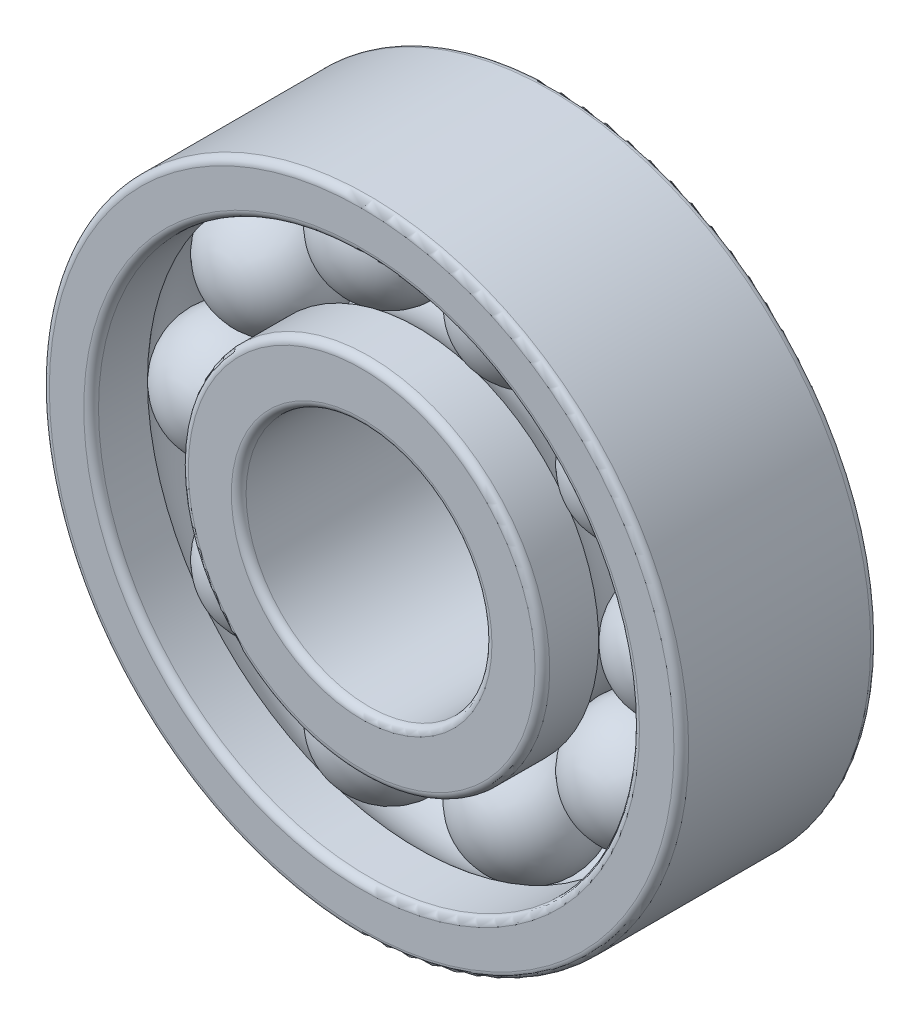
ISO-10303-21;
HEADER;
FILE_DESCRIPTION(('STEP AP214'),'2;1');
FILE_NAME('part.step','',(''),(''),'','','');
FILE_SCHEMA(('AUTOMOTIVE_DESIGN { 1 0 10303 214 1 1 1 1 }'));
ENDSEC;
DATA;
#1=APPLICATION_CONTEXT('core data for automotive mechanical design processes');
#2=APPLICATION_PROTOCOL_DEFINITION('international standard','automotive_design',2000,#1);
#3=PRODUCT_CONTEXT('',#1,'mechanical');
#4=PRODUCT('Part','Part','',(#3));
#5=PRODUCT_RELATED_PRODUCT_CATEGORY('part','',(#4));
#6=PRODUCT_DEFINITION_FORMATION('','',#4);
#7=PRODUCT_DEFINITION_CONTEXT('part definition',#1,'design');
#8=PRODUCT_DEFINITION('design','',#6,#7);
#9=PRODUCT_DEFINITION_SHAPE('','',#8);
#10=(LENGTH_UNIT() NAMED_UNIT(*) SI_UNIT(.MILLI.,.METRE.));
#11=(NAMED_UNIT(*) PLANE_ANGLE_UNIT() SI_UNIT($,.RADIAN.));
#12=(NAMED_UNIT(*) SI_UNIT($,.STERADIAN.) SOLID_ANGLE_UNIT());
#13=UNCERTAINTY_MEASURE_WITH_UNIT(LENGTH_MEASURE(1.E-05),#10,'distance_accuracy_value','');
#14=(GEOMETRIC_REPRESENTATION_CONTEXT(3) GLOBAL_UNCERTAINTY_ASSIGNED_CONTEXT((#13)) GLOBAL_UNIT_ASSIGNED_CONTEXT((#10,
#11,#12)) REPRESENTATION_CONTEXT('',''));
#15=CARTESIAN_POINT('',(0.,0.,0.));
#16=DIRECTION('',(0.,0.,1.));
#17=DIRECTION('',(1.,0.,0.));
#18=AXIS2_PLACEMENT_3D('',#15,#16,#17);
#19=CARTESIAN_POINT('',(-7.42273092339021,5.39292968978334,4.));
#20=DIRECTION('',(0.,0.,-1.));
#21=DIRECTION('',(0.809016994374955,-0.587785252292462,0.));
#22=AXIS2_PLACEMENT_3D('',#19,#20,#21);
#23=SPHERICAL_SURFACE('',#22,2.5);
#24=CARTESIAN_POINT('',(-7.42273092339021,5.39292968978334,1.5));
#25=VERTEX_POINT('',#24);
#26=VERTEX_LOOP('',#25);
#27=FACE_BOUND('',#26,.T.);
#28=ADVANCED_FACE('F74',(#27),#23,.T.);
#29=CLOSED_SHELL('',(#28));
#30=MANIFOLD_SOLID_BREP('B2',#29);
#31=CARTESIAN_POINT('',(-2.83523092339024,8.725943537008,4.));
#32=DIRECTION('',(0.,0.,-1.));
#33=DIRECTION('',(0.309016994374958,-0.95105651629515,0.));
#34=AXIS2_PLACEMENT_3D('',#31,#32,#33);
#35=SPHERICAL_SURFACE('',#34,2.5);
#36=CARTESIAN_POINT('',(-2.83523092339024,8.725943537008,1.5));
#37=VERTEX_POINT('',#36);
#38=VERTEX_LOOP('',#37);
#39=FACE_BOUND('',#38,.T.);
#40=ADVANCED_FACE('F93',(#39),#35,.T.);
#41=CLOSED_SHELL('',(#40));
#42=MANIFOLD_SOLID_BREP('B7',#41);
#43=CARTESIAN_POINT('',(2.83523092339006,8.72594353700806,4.));
#44=DIRECTION('',(0.,0.,-1.));
#45=DIRECTION('',(-0.309016994374938,-0.951056516295157,0.));
#46=AXIS2_PLACEMENT_3D('',#43,#44,#45);
#47=SPHERICAL_SURFACE('',#46,2.5);
#48=CARTESIAN_POINT('',(2.83523092339006,8.72594353700806,1.5));
#49=VERTEX_POINT('',#48);
#50=VERTEX_LOOP('',#49);
#51=FACE_BOUND('',#50,.T.);
#52=ADVANCED_FACE('F112',(#51),#47,.T.);
#53=CLOSED_SHELL('',(#52));
#54=MANIFOLD_SOLID_BREP('B70',#53);
#55=CARTESIAN_POINT('',(7.4227309233901,5.39292968978351,4.));
#56=DIRECTION('',(0.,0.,-1.));
#57=DIRECTION('',(-0.809016994374942,-0.58778525229248,0.));
#58=AXIS2_PLACEMENT_3D('',#55,#56,#57);
#59=SPHERICAL_SURFACE('',#58,2.5);
#60=CARTESIAN_POINT('',(7.4227309233901,5.39292968978351,1.5));
#61=VERTEX_POINT('',#60);
#62=VERTEX_LOOP('',#61);
#63=FACE_BOUND('',#62,.T.);
#64=ADVANCED_FACE('F131',(#63),#59,.T.);
#65=CLOSED_SHELL('',(#64));
#66=MANIFOLD_SOLID_BREP('B89',#65);
#67=CARTESIAN_POINT('',(9.175,0.,4.));
#68=DIRECTION('',(0.,0.,-1.));
#69=DIRECTION('',(-1.,0.,0.));
#70=AXIS2_PLACEMENT_3D('',#67,#68,#69);
#71=SPHERICAL_SURFACE('',#70,2.5);
#72=CARTESIAN_POINT('',(9.175,0.,1.5));
#73=VERTEX_POINT('',#72);
#74=VERTEX_LOOP('',#73);
#75=FACE_BOUND('',#74,.T.);
#76=ADVANCED_FACE('F150',(#75),#71,.T.);
#77=CLOSED_SHELL('',(#76));
#78=MANIFOLD_SOLID_BREP('B108',#77);
#79=CARTESIAN_POINT('',(7.42273092339017,-5.3929296897834,4.));
#80=DIRECTION('',(0.,0.,-1.));
#81=DIRECTION('',(-0.809016994374951,0.587785252292469,0.));
#82=AXIS2_PLACEMENT_3D('',#79,#80,#81);
#83=SPHERICAL_SURFACE('',#82,2.5);
#84=CARTESIAN_POINT('',(7.42273092339017,-5.3929296897834,1.5));
#85=VERTEX_POINT('',#84);
#86=VERTEX_LOOP('',#85);
#87=FACE_BOUND('',#86,.T.);
#88=ADVANCED_FACE('F169',(#87),#83,.T.);
#89=CLOSED_SHELL('',(#88));
#90=MANIFOLD_SOLID_BREP('B127',#89);
#91=CARTESIAN_POINT('',(2.83523092339018,-8.72594353700802,4.));
#92=DIRECTION('',(0.,0.,-1.));
#93=DIRECTION('',(-0.309016994374952,0.951056516295152,0.));
#94=AXIS2_PLACEMENT_3D('',#91,#92,#93);
#95=SPHERICAL_SURFACE('',#94,2.5);
#96=CARTESIAN_POINT('',(2.83523092339018,-8.72594353700802,1.5));
#97=VERTEX_POINT('',#96);
#98=VERTEX_LOOP('',#97);
#99=FACE_BOUND('',#98,.T.);
#100=ADVANCED_FACE('F188',(#99),#95,.T.);
#101=CLOSED_SHELL('',(#100));
#102=MANIFOLD_SOLID_BREP('B146',#101);
#103=CARTESIAN_POINT('',(-2.83523092339012,-8.72594353700804,4.));
#104=DIRECTION('',(0.,0.,-1.));
#105=DIRECTION('',(0.309016994374945,0.951056516295155,0.));
#106=AXIS2_PLACEMENT_3D('',#103,#104,#105);
#107=SPHERICAL_SURFACE('',#106,2.5);
#108=CARTESIAN_POINT('',(-2.83523092339012,-8.72594353700804,1.5));
#109=VERTEX_POINT('',#108);
#110=VERTEX_LOOP('',#109);
#111=FACE_BOUND('',#110,.T.);
#112=ADVANCED_FACE('F207',(#111),#107,.T.);
#113=CLOSED_SHELL('',(#112));
#114=MANIFOLD_SOLID_BREP('B165',#113);
#115=CARTESIAN_POINT('',(-7.42273092339014,-5.39292968978345,4.));
#116=DIRECTION('',(0.,0.,-1.));
#117=DIRECTION('',(0.809016994374947,0.587785252292474,0.));
#118=AXIS2_PLACEMENT_3D('',#115,#116,#117);
#119=SPHERICAL_SURFACE('',#118,2.5);
#120=CARTESIAN_POINT('',(-7.42273092339014,-5.39292968978345,1.5));
#121=VERTEX_POINT('',#120);
#122=VERTEX_LOOP('',#121);
#123=FACE_BOUND('',#122,.T.);
#124=ADVANCED_FACE('F226',(#123),#119,.T.);
#125=CLOSED_SHELL('',(#124));
#126=MANIFOLD_SOLID_BREP('B184',#125);
#127=CARTESIAN_POINT('',(-9.175,0.,4.));
#128=DIRECTION('',(0.,0.,-1.));
#129=DIRECTION('',(1.,0.,0.));
#130=AXIS2_PLACEMENT_3D('',#127,#128,#129);
#131=SPHERICAL_SURFACE('',#130,2.5);
#132=CARTESIAN_POINT('',(-9.175,0.,1.5));
#133=VERTEX_POINT('',#132);
#134=VERTEX_LOOP('',#133);
#135=FACE_BOUND('',#134,.T.);
#136=ADVANCED_FACE('F247',(#135),#131,.T.);
#137=CLOSED_SHELL('',(#136));
#138=MANIFOLD_SOLID_BREP('B203',#137);
#139=CARTESIAN_POINT('',(0.,0.,8.));
#140=DIRECTION('',(0.,0.,-1.));
#141=DIRECTION('',(-1.,0.,0.));
#142=AXIS2_PLACEMENT_3D('',#139,#140,#141);
#143=CYLINDRICAL_SURFACE('',#142,7.35);
#144=CARTESIAN_POINT('',(0.,0.,0.3));
#145=DIRECTION('',(0.,0.,1.));
#146=DIRECTION('',(1.,0.,0.));
#147=AXIS2_PLACEMENT_3D('',#144,#145,#146);
#148=CIRCLE('',#147,7.35);
#149=CARTESIAN_POINT('',(7.35,0.,0.3));
#150=VERTEX_POINT('',#149);
#151=EDGE_CURVE('E246',#150,#150,#148,.T.);
#152=ORIENTED_EDGE('',*,*,#151,.T.);
#153=EDGE_LOOP('',(#152));
#154=FACE_BOUND('',#153,.T.);
#155=CARTESIAN_POINT('',(0.,0.,2.29138213751582));
#156=DIRECTION('',(0.,0.,1.));
#157=DIRECTION('',(1.,0.,0.));
#158=AXIS2_PLACEMENT_3D('',#155,#156,#157);
#159=CIRCLE('',#158,7.35);
#160=CARTESIAN_POINT('',(7.35,0.,2.29138213751582));
#161=VERTEX_POINT('',#160);
#162=EDGE_CURVE('E299',#161,#161,#159,.F.);
#163=ORIENTED_EDGE('',*,*,#162,.T.);
#164=EDGE_LOOP('',(#163));
#165=FACE_BOUND('',#164,.T.);
#166=ADVANCED_FACE('F267',(#154,#165),#143,.T.);
#167=CARTESIAN_POINT('',(0.,0.,8.));
#168=DIRECTION('',(0.,0.,1.));
#169=DIRECTION('',(1.,0.,0.));
#170=AXIS2_PLACEMENT_3D('',#167,#168,#169);
#171=PLANE('',#170);
#172=CARTESIAN_POINT('',(0.,0.,8.));
#173=DIRECTION('',(0.,0.,1.));
#174=DIRECTION('',(1.,0.,0.));
#175=AXIS2_PLACEMENT_3D('',#172,#173,#174);
#176=CIRCLE('',#175,5.3);
#177=CARTESIAN_POINT('',(5.3,0.,8.));
#178=VERTEX_POINT('',#177);
#179=EDGE_CURVE('E287',#178,#178,#176,.F.);
#180=ORIENTED_EDGE('',*,*,#179,.T.);
#181=EDGE_LOOP('',(#180));
#182=FACE_BOUND('',#181,.T.);
#183=CARTESIAN_POINT('',(0.,0.,8.));
#184=DIRECTION('',(0.,0.,1.));
#185=DIRECTION('',(1.,0.,0.));
#186=AXIS2_PLACEMENT_3D('',#183,#184,#185);
#187=CIRCLE('',#186,7.05);
#188=CARTESIAN_POINT('',(7.05,0.,8.));
#189=VERTEX_POINT('',#188);
#190=EDGE_CURVE('E290',#189,#189,#187,.T.);
#191=ORIENTED_EDGE('',*,*,#190,.T.);
#192=EDGE_LOOP('',(#191));
#193=FACE_BOUND('',#192,.T.);
#194=ADVANCED_FACE('F317',(#182,#193),#171,.T.);
#195=CARTESIAN_POINT('',(0.,0.,0.));
#196=DIRECTION('',(0.,0.,1.));
#197=DIRECTION('',(1.,0.,0.));
#198=AXIS2_PLACEMENT_3D('',#195,#196,#197);
#199=PLANE('',#198);
#200=CARTESIAN_POINT('',(0.,0.,0.));
#201=DIRECTION('',(0.,0.,1.));
#202=DIRECTION('',(1.,0.,0.));
#203=AXIS2_PLACEMENT_3D('',#200,#201,#202);
#204=CIRCLE('',#203,5.3);
#205=CARTESIAN_POINT('',(5.3,0.,0.));
#206=VERTEX_POINT('',#205);
#207=EDGE_CURVE('E274',#206,#206,#204,.T.);
#208=ORIENTED_EDGE('',*,*,#207,.T.);
#209=EDGE_LOOP('',(#208));
#210=FACE_BOUND('',#209,.T.);
#211=CARTESIAN_POINT('',(0.,0.,0.));
#212=DIRECTION('',(0.,0.,1.));
#213=DIRECTION('',(1.,0.,0.));
#214=AXIS2_PLACEMENT_3D('',#211,#212,#213);
#215=CIRCLE('',#214,7.05);
#216=CARTESIAN_POINT('',(7.05,0.,0.));
#217=VERTEX_POINT('',#216);
#218=EDGE_CURVE('E278',#217,#217,#215,.F.);
#219=ORIENTED_EDGE('',*,*,#218,.T.);
#220=EDGE_LOOP('',(#219));
#221=FACE_BOUND('',#220,.T.);
#222=ADVANCED_FACE('F322',(#210,#221),#199,.F.);
#223=CARTESIAN_POINT('',(0.,0.,7.7));
#224=DIRECTION('',(0.,0.,1.));
#225=DIRECTION('',(1.,0.,0.));
#226=AXIS2_PLACEMENT_3D('',#223,#224,#225);
#227=CIRCLE('',#226,7.35);
#228=CARTESIAN_POINT('',(7.35,0.,7.7));
#229=VERTEX_POINT('',#228);
#230=EDGE_CURVE('E282',#229,#229,#227,.F.);
#231=ORIENTED_EDGE('',*,*,#230,.T.);
#232=EDGE_LOOP('',(#231));
#233=FACE_BOUND('',#232,.T.);
#234=CARTESIAN_POINT('',(0.,0.,5.70861786248418));
#235=DIRECTION('',(0.,0.,-1.));
#236=DIRECTION('',(-1.,0.,0.));
#237=AXIS2_PLACEMENT_3D('',#234,#235,#236);
#238=CIRCLE('',#237,7.35);
#239=CARTESIAN_POINT('',(-7.35,0.,5.70861786248418));
#240=VERTEX_POINT('',#239);
#241=EDGE_CURVE('E302',#240,#240,#238,.F.);
#242=ORIENTED_EDGE('',*,*,#241,.T.);
#243=EDGE_LOOP('',(#242));
#244=FACE_BOUND('',#243,.T.);
#245=ADVANCED_FACE('F306',(#233,#244),#143,.T.);
#246=CARTESIAN_POINT('',(0.,0.,8.));
#247=DIRECTION('',(0.,0.,-1.));
#248=DIRECTION('',(-1.,0.,0.));
#249=AXIS2_PLACEMENT_3D('',#246,#247,#248);
#250=CYLINDRICAL_SURFACE('',#249,5.);
#251=CARTESIAN_POINT('',(0.,0.,7.7));
#252=DIRECTION('',(0.,0.,1.));
#253=DIRECTION('',(1.,0.,0.));
#254=AXIS2_PLACEMENT_3D('',#251,#252,#253);
#255=CIRCLE('',#254,5.);
#256=CARTESIAN_POINT('',(5.,0.,7.7));
#257=VERTEX_POINT('',#256);
#258=EDGE_CURVE('E293',#257,#257,#255,.T.);
#259=ORIENTED_EDGE('',*,*,#258,.T.);
#260=EDGE_LOOP('',(#259));
#261=FACE_BOUND('',#260,.T.);
#262=CARTESIAN_POINT('',(0.,0.,0.3));
#263=DIRECTION('',(0.,0.,1.));
#264=DIRECTION('',(1.,0.,0.));
#265=AXIS2_PLACEMENT_3D('',#262,#263,#264);
#266=CIRCLE('',#265,5.);
#267=CARTESIAN_POINT('',(5.,0.,0.3));
#268=VERTEX_POINT('',#267);
#269=EDGE_CURVE('E296',#268,#268,#266,.F.);
#270=ORIENTED_EDGE('',*,*,#269,.T.);
#271=EDGE_LOOP('',(#270));
#272=FACE_BOUND('',#271,.T.);
#273=ADVANCED_FACE('F312',(#261,#272),#250,.F.);
#274=CARTESIAN_POINT('',(0.,0.,4.));
#275=DIRECTION('',(0.,0.,-1.));
#276=DIRECTION('',(-1.,0.,0.));
#277=AXIS2_PLACEMENT_3D('',#274,#275,#276);
#278=TOROIDAL_SURFACE('',#277,9.175,2.5);
#279=ORIENTED_EDGE('',*,*,#241,.F.);
#280=EDGE_LOOP('',(#279));
#281=FACE_BOUND('',#280,.T.);
#282=ORIENTED_EDGE('',*,*,#162,.F.);
#283=EDGE_LOOP('',(#282));
#284=FACE_BOUND('',#283,.T.);
#285=ADVANCED_FACE('F308',(#281,#284),#278,.F.);
#286=CARTESIAN_POINT('',(0.,0.,7.7));
#287=DIRECTION('',(0.,0.,1.));
#288=DIRECTION('',(1.,0.,0.));
#289=AXIS2_PLACEMENT_3D('',#286,#287,#288);
#290=TOROIDAL_SURFACE('',#289,5.3,0.3);
#291=ORIENTED_EDGE('',*,*,#179,.F.);
#292=EDGE_LOOP('',(#291));
#293=FACE_BOUND('',#292,.T.);
#294=ORIENTED_EDGE('',*,*,#258,.F.);
#295=EDGE_LOOP('',(#294));
#296=FACE_BOUND('',#295,.T.);
#297=ADVANCED_FACE('F311',(#293,#296),#290,.T.);
#298=CARTESIAN_POINT('',(0.,0.,7.7));
#299=DIRECTION('',(0.,0.,1.));
#300=DIRECTION('',(1.,0.,0.));
#301=AXIS2_PLACEMENT_3D('',#298,#299,#300);
#302=TOROIDAL_SURFACE('',#301,7.05,0.3);
#303=ORIENTED_EDGE('',*,*,#230,.F.);
#304=EDGE_LOOP('',(#303));
#305=FACE_BOUND('',#304,.T.);
#306=ORIENTED_EDGE('',*,*,#190,.F.);
#307=EDGE_LOOP('',(#306));
#308=FACE_BOUND('',#307,.T.);
#309=ADVANCED_FACE('F336',(#305,#308),#302,.T.);
#310=CARTESIAN_POINT('',(0.,0.,0.3));
#311=DIRECTION('',(0.,0.,1.));
#312=DIRECTION('',(1.,0.,0.));
#313=AXIS2_PLACEMENT_3D('',#310,#311,#312);
#314=TOROIDAL_SURFACE('',#313,5.3,0.3);
#315=ORIENTED_EDGE('',*,*,#269,.F.);
#316=EDGE_LOOP('',(#315));
#317=FACE_BOUND('',#316,.T.);
#318=ORIENTED_EDGE('',*,*,#207,.F.);
#319=EDGE_LOOP('',(#318));
#320=FACE_BOUND('',#319,.T.);
#321=ADVANCED_FACE('F339',(#317,#320),#314,.T.);
#322=CARTESIAN_POINT('',(0.,0.,0.3));
#323=DIRECTION('',(0.,0.,1.));
#324=DIRECTION('',(1.,0.,0.));
#325=AXIS2_PLACEMENT_3D('',#322,#323,#324);
#326=TOROIDAL_SURFACE('',#325,7.05,0.3);
#327=ORIENTED_EDGE('',*,*,#218,.F.);
#328=EDGE_LOOP('',(#327));
#329=FACE_BOUND('',#328,.T.);
#330=ORIENTED_EDGE('',*,*,#151,.F.);
#331=EDGE_LOOP('',(#330));
#332=FACE_BOUND('',#331,.T.);
#333=ADVANCED_FACE('F269',(#329,#332),#326,.T.);
#334=CLOSED_SHELL('',(#166,#194,#222,#245,#273,#285,#297,#309,#321,#333));
#335=MANIFOLD_SOLID_BREP('B222',#334);
#336=CARTESIAN_POINT('',(0.,0.,8.));
#337=DIRECTION('',(0.,0.,-1.));
#338=DIRECTION('',(-1.,0.,0.));
#339=AXIS2_PLACEMENT_3D('',#336,#337,#338);
#340=CYLINDRICAL_SURFACE('',#339,11.);
#341=CARTESIAN_POINT('',(0.,0.,0.3));
#342=DIRECTION('',(0.,0.,1.));
#343=DIRECTION('',(1.,0.,0.));
#344=AXIS2_PLACEMENT_3D('',#341,#342,#343);
#345=CIRCLE('',#344,11.);
#346=CARTESIAN_POINT('',(11.,0.,0.3));
#347=VERTEX_POINT('',#346);
#348=EDGE_CURVE('E441',#347,#347,#345,.F.);
#349=ORIENTED_EDGE('',*,*,#348,.T.);
#350=EDGE_LOOP('',(#349));
#351=FACE_BOUND('',#350,.T.);
#352=CARTESIAN_POINT('',(0.,0.,2.29138213751582));
#353=DIRECTION('',(0.,0.,1.));
#354=DIRECTION('',(1.,0.,0.));
#355=AXIS2_PLACEMENT_3D('',#352,#353,#354);
#356=CIRCLE('',#355,11.);
#357=CARTESIAN_POINT('',(11.,0.,2.29138213751582));
#358=VERTEX_POINT('',#357);
#359=EDGE_CURVE('E450',#358,#358,#356,.F.);
#360=ORIENTED_EDGE('',*,*,#359,.F.);
#361=EDGE_LOOP('',(#360));
#362=FACE_BOUND('',#361,.T.);
#363=ADVANCED_FACE('F418',(#351,#362),#340,.F.);
#364=CARTESIAN_POINT('',(0.,0.,8.));
#365=DIRECTION('',(0.,0.,1.));
#366=DIRECTION('',(1.,0.,0.));
#367=AXIS2_PLACEMENT_3D('',#364,#365,#366);
#368=PLANE('',#367);
#369=CARTESIAN_POINT('',(0.,0.,8.));
#370=DIRECTION('',(0.,0.,1.));
#371=DIRECTION('',(1.,0.,0.));
#372=AXIS2_PLACEMENT_3D('',#369,#370,#371);
#373=CIRCLE('',#372,11.3);
#374=CARTESIAN_POINT('',(11.3,0.,8.));
#375=VERTEX_POINT('',#374);
#376=EDGE_CURVE('E266',#375,#375,#373,.F.);
#377=ORIENTED_EDGE('',*,*,#376,.T.);
#378=EDGE_LOOP('',(#377));
#379=FACE_BOUND('',#378,.T.);
#380=CARTESIAN_POINT('',(0.,0.,8.));
#381=DIRECTION('',(0.,0.,1.));
#382=DIRECTION('',(1.,0.,0.));
#383=AXIS2_PLACEMENT_3D('',#380,#381,#382);
#384=CIRCLE('',#383,12.7);
#385=CARTESIAN_POINT('',(12.7,0.,8.));
#386=VERTEX_POINT('',#385);
#387=EDGE_CURVE('E425',#386,#386,#384,.T.);
#388=ORIENTED_EDGE('',*,*,#387,.T.);
#389=EDGE_LOOP('',(#388));
#390=FACE_BOUND('',#389,.T.);
#391=ADVANCED_FACE('F476',(#379,#390),#368,.T.);
#392=CARTESIAN_POINT('',(0.,0.,0.));
#393=DIRECTION('',(0.,0.,1.));
#394=DIRECTION('',(1.,0.,0.));
#395=AXIS2_PLACEMENT_3D('',#392,#393,#394);
#396=PLANE('',#395);
#397=CARTESIAN_POINT('',(0.,0.,0.));
#398=DIRECTION('',(0.,0.,1.));
#399=DIRECTION('',(1.,0.,0.));
#400=AXIS2_PLACEMENT_3D('',#397,#398,#399);
#401=CIRCLE('',#400,11.3);
#402=CARTESIAN_POINT('',(11.3,0.,0.));
#403=VERTEX_POINT('',#402);
#404=EDGE_CURVE('E444',#403,#403,#401,.T.);
#405=ORIENTED_EDGE('',*,*,#404,.T.);
#406=EDGE_LOOP('',(#405));
#407=FACE_BOUND('',#406,.T.);
#408=CARTESIAN_POINT('',(0.,0.,0.));
#409=DIRECTION('',(0.,0.,1.));
#410=DIRECTION('',(1.,0.,0.));
#411=AXIS2_PLACEMENT_3D('',#408,#409,#410);
#412=CIRCLE('',#411,12.7);
#413=CARTESIAN_POINT('',(12.7,0.,0.));
#414=VERTEX_POINT('',#413);
#415=EDGE_CURVE('E447',#414,#414,#412,.F.);
#416=ORIENTED_EDGE('',*,*,#415,.T.);
#417=EDGE_LOOP('',(#416));
#418=FACE_BOUND('',#417,.T.);
#419=ADVANCED_FACE('F471',(#407,#418),#396,.F.);
#420=CARTESIAN_POINT('',(0.,0.,8.));
#421=DIRECTION('',(0.,0.,-1.));
#422=DIRECTION('',(-1.,0.,0.));
#423=AXIS2_PLACEMENT_3D('',#420,#421,#422);
#424=CYLINDRICAL_SURFACE('',#423,13.);
#425=CARTESIAN_POINT('',(0.,0.,0.3));
#426=DIRECTION('',(0.,0.,1.));
#427=DIRECTION('',(1.,0.,0.));
#428=AXIS2_PLACEMENT_3D('',#425,#426,#427);
#429=CIRCLE('',#428,13.);
#430=CARTESIAN_POINT('',(13.,0.,0.3));
#431=VERTEX_POINT('',#430);
#432=EDGE_CURVE('E433',#431,#431,#429,.T.);
#433=ORIENTED_EDGE('',*,*,#432,.T.);
#434=EDGE_LOOP('',(#433));
#435=FACE_BOUND('',#434,.T.);
#436=CARTESIAN_POINT('',(0.,0.,7.7));
#437=DIRECTION('',(0.,0.,1.));
#438=DIRECTION('',(1.,0.,0.));
#439=AXIS2_PLACEMENT_3D('',#436,#437,#438);
#440=CIRCLE('',#439,13.);
#441=CARTESIAN_POINT('',(13.,0.,7.7));
#442=VERTEX_POINT('',#441);
#443=EDGE_CURVE('E438',#442,#442,#440,.F.);
#444=ORIENTED_EDGE('',*,*,#443,.T.);
#445=EDGE_LOOP('',(#444));
#446=FACE_BOUND('',#445,.T.);
#447=ADVANCED_FACE('F461',(#435,#446),#424,.T.);
#448=CARTESIAN_POINT('',(0.,0.,7.7));
#449=DIRECTION('',(0.,0.,1.));
#450=DIRECTION('',(1.,0.,0.));
#451=AXIS2_PLACEMENT_3D('',#448,#449,#450);
#452=CIRCLE('',#451,11.);
#453=CARTESIAN_POINT('',(11.,0.,7.7));
#454=VERTEX_POINT('',#453);
#455=EDGE_CURVE('E429',#454,#454,#452,.T.);
#456=ORIENTED_EDGE('',*,*,#455,.T.);
#457=EDGE_LOOP('',(#456));
#458=FACE_BOUND('',#457,.T.);
#459=CARTESIAN_POINT('',(0.,0.,5.70861786248418));
#460=DIRECTION('',(0.,0.,-1.));
#461=DIRECTION('',(-1.,0.,0.));
#462=AXIS2_PLACEMENT_3D('',#459,#460,#461);
#463=CIRCLE('',#462,11.);
#464=CARTESIAN_POINT('',(-11.,0.,5.70861786248418));
#465=VERTEX_POINT('',#464);
#466=EDGE_CURVE('E453',#465,#465,#463,.F.);
#467=ORIENTED_EDGE('',*,*,#466,.F.);
#468=EDGE_LOOP('',(#467));
#469=FACE_BOUND('',#468,.T.);
#470=ADVANCED_FACE('F459',(#458,#469),#340,.F.);
#471=CARTESIAN_POINT('',(0.,0.,4.));
#472=DIRECTION('',(0.,0.,-1.));
#473=DIRECTION('',(-1.,0.,0.));
#474=AXIS2_PLACEMENT_3D('',#471,#472,#473);
#475=TOROIDAL_SURFACE('',#474,9.175,2.5);
#476=ORIENTED_EDGE('',*,*,#359,.T.);
#477=EDGE_LOOP('',(#476));
#478=FACE_BOUND('',#477,.T.);
#479=ORIENTED_EDGE('',*,*,#466,.T.);
#480=EDGE_LOOP('',(#479));
#481=FACE_BOUND('',#480,.T.);
#482=ADVANCED_FACE('F457',(#478,#481),#475,.F.);
#483=CARTESIAN_POINT('',(0.,0.,0.3));
#484=DIRECTION('',(0.,0.,1.));
#485=DIRECTION('',(1.,0.,0.));
#486=AXIS2_PLACEMENT_3D('',#483,#484,#485);
#487=TOROIDAL_SURFACE('',#486,11.3,0.3);
#488=ORIENTED_EDGE('',*,*,#348,.F.);
#489=EDGE_LOOP('',(#488));
#490=FACE_BOUND('',#489,.T.);
#491=ORIENTED_EDGE('',*,*,#404,.F.);
#492=EDGE_LOOP('',(#491));
#493=FACE_BOUND('',#492,.T.);
#494=ADVANCED_FACE('F468',(#490,#493),#487,.T.);
#495=CARTESIAN_POINT('',(0.,0.,0.3));
#496=DIRECTION('',(0.,0.,1.));
#497=DIRECTION('',(1.,0.,0.));
#498=AXIS2_PLACEMENT_3D('',#495,#496,#497);
#499=TOROIDAL_SURFACE('',#498,12.7,0.3);
#500=ORIENTED_EDGE('',*,*,#415,.F.);
#501=EDGE_LOOP('',(#500));
#502=FACE_BOUND('',#501,.T.);
#503=ORIENTED_EDGE('',*,*,#432,.F.);
#504=EDGE_LOOP('',(#503));
#505=FACE_BOUND('',#504,.T.);
#506=ADVANCED_FACE('F487',(#502,#505),#499,.T.);
#507=CARTESIAN_POINT('',(0.,0.,7.7));
#508=DIRECTION('',(0.,0.,1.));
#509=DIRECTION('',(1.,0.,0.));
#510=AXIS2_PLACEMENT_3D('',#507,#508,#509);
#511=TOROIDAL_SURFACE('',#510,11.3,0.3);
#512=ORIENTED_EDGE('',*,*,#376,.F.);
#513=EDGE_LOOP('',(#512));
#514=FACE_BOUND('',#513,.T.);
#515=ORIENTED_EDGE('',*,*,#455,.F.);
#516=EDGE_LOOP('',(#515));
#517=FACE_BOUND('',#516,.T.);
#518=ADVANCED_FACE('F498',(#514,#517),#511,.T.);
#519=CARTESIAN_POINT('',(0.,0.,7.7));
#520=DIRECTION('',(0.,0.,1.));
#521=DIRECTION('',(1.,0.,0.));
#522=AXIS2_PLACEMENT_3D('',#519,#520,#521);
#523=TOROIDAL_SURFACE('',#522,12.7,0.3);
#524=ORIENTED_EDGE('',*,*,#443,.F.);
#525=EDGE_LOOP('',(#524));
#526=FACE_BOUND('',#525,.T.);
#527=ORIENTED_EDGE('',*,*,#387,.F.);
#528=EDGE_LOOP('',(#527));
#529=FACE_BOUND('',#528,.T.);
#530=ADVANCED_FACE('F420',(#526,#529),#523,.T.);
#531=CLOSED_SHELL('',(#363,#391,#419,#447,#470,#482,#494,#506,#518,#530));
#532=MANIFOLD_SOLID_BREP('B241',#531);
#533=ADVANCED_BREP_SHAPE_REPRESENTATION('',(#18,#30,#42,#54,#66,#78,#90,#102,#114,#126,#138,
#335,#532),#14);
#534=SHAPE_DEFINITION_REPRESENTATION(#9,#533);
ENDSEC;
END-ISO-10303-21;
